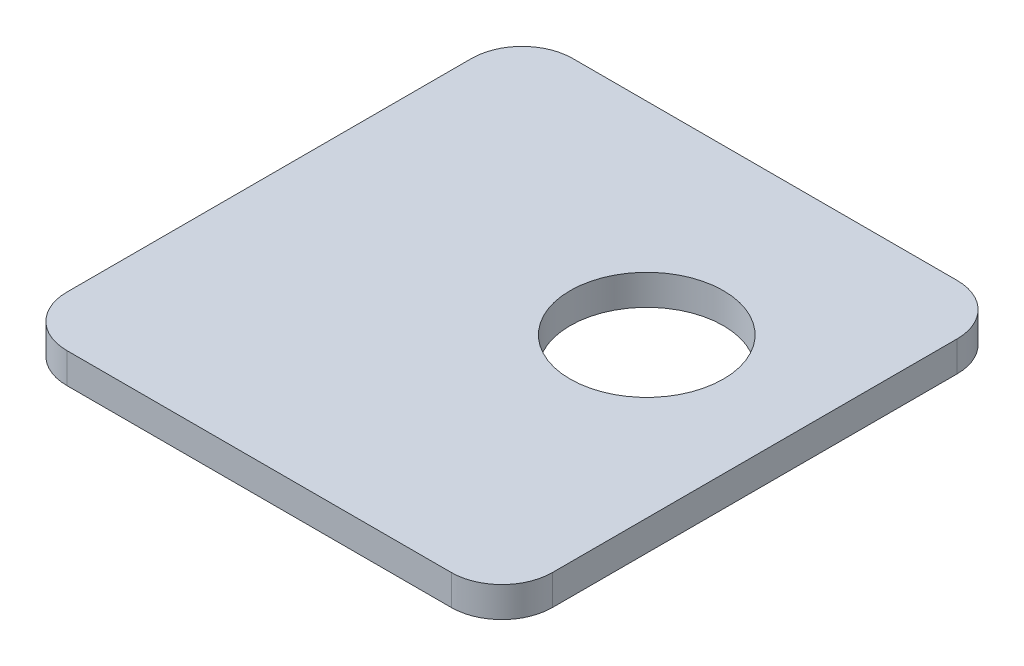
ISO-10303-21;
HEADER;
FILE_DESCRIPTION(('STEP AP214'),'2;1');
FILE_NAME('part.step','',(''),(''),'','','');
FILE_SCHEMA(('AUTOMOTIVE_DESIGN { 1 0 10303 214 1 1 1 1 }'));
ENDSEC;
DATA;
#1=APPLICATION_CONTEXT('core data for automotive mechanical design processes');
#2=APPLICATION_PROTOCOL_DEFINITION('international standard','automotive_design',2000,#1);
#3=PRODUCT_CONTEXT('',#1,'mechanical');
#4=PRODUCT('Part','Part','',(#3));
#5=PRODUCT_RELATED_PRODUCT_CATEGORY('part','',(#4));
#6=PRODUCT_DEFINITION_FORMATION('','',#4);
#7=PRODUCT_DEFINITION_CONTEXT('part definition',#1,'design');
#8=PRODUCT_DEFINITION('design','',#6,#7);
#9=PRODUCT_DEFINITION_SHAPE('','',#8);
#10=(LENGTH_UNIT() NAMED_UNIT(*) SI_UNIT(.MILLI.,.METRE.));
#11=(NAMED_UNIT(*) PLANE_ANGLE_UNIT() SI_UNIT($,.RADIAN.));
#12=(NAMED_UNIT(*) SI_UNIT($,.STERADIAN.) SOLID_ANGLE_UNIT());
#13=UNCERTAINTY_MEASURE_WITH_UNIT(LENGTH_MEASURE(1.E-05),#10,'distance_accuracy_value','');
#14=(GEOMETRIC_REPRESENTATION_CONTEXT(3) GLOBAL_UNCERTAINTY_ASSIGNED_CONTEXT((#13)) GLOBAL_UNIT_ASSIGNED_CONTEXT((#10,
#11,#12)) REPRESENTATION_CONTEXT('',''));
#15=CARTESIAN_POINT('',(0.,0.,0.));
#16=DIRECTION('',(0.,0.,1.));
#17=DIRECTION('',(1.,0.,0.));
#18=AXIS2_PLACEMENT_3D('',#15,#16,#17);
#19=CARTESIAN_POINT('',(-19.4222911704242,3.,-24.2066548338471));
#20=DIRECTION('',(0.,-1.,0.));
#21=DIRECTION('',(0.,0.,-1.));
#22=AXIS2_PLACEMENT_3D('',#19,#20,#21);
#23=PLANE('',#22);
#24=CARTESIAN_POINT('',(-19.4222911704242,3.,-24.2066548338471));
#25=DIRECTION('',(0.,1.,0.));
#26=DIRECTION('',(0.,0.,-1.));
#27=AXIS2_PLACEMENT_3D('',#24,#25,#26);
#28=CIRCLE('',#27,5.);
#29=CARTESIAN_POINT('',(-19.4222911704242,3.,-29.2066548338471));
#30=VERTEX_POINT('',#29);
#31=CARTESIAN_POINT('',(-24.4222911704242,3.,-24.2066548338471));
#32=VERTEX_POINT('',#31);
#33=EDGE_CURVE('E145',#30,#32,#28,.T.);
#34=ORIENTED_EDGE('',*,*,#33,.T.);
#35=DIRECTION('',(0.,0.,1.));
#36=VECTOR('',#35,1.);
#37=CARTESIAN_POINT('',(-24.4222911704242,3.,-24.2066548338471));
#38=LINE('',#37,#36);
#39=CARTESIAN_POINT('',(-24.4222911704242,3.,15.7933451661529));
#40=VERTEX_POINT('',#39);
#41=EDGE_CURVE('E93',#32,#40,#38,.T.);
#42=ORIENTED_EDGE('',*,*,#41,.T.);
#43=CARTESIAN_POINT('',(-19.4222911704242,3.,15.7933451661529));
#44=DIRECTION('',(0.,1.,0.));
#45=DIRECTION('',(0.,0.,1.));
#46=AXIS2_PLACEMENT_3D('',#43,#44,#45);
#47=CIRCLE('',#46,5.);
#48=CARTESIAN_POINT('',(-19.4222911704242,3.,20.7933451661529));
#49=VERTEX_POINT('',#48);
#50=EDGE_CURVE('E160',#40,#49,#47,.T.);
#51=ORIENTED_EDGE('',*,*,#50,.T.);
#52=DIRECTION('',(1.,0.,0.));
#53=VECTOR('',#52,1.);
#54=CARTESIAN_POINT('',(-19.4222911704241,3.,20.7933451661529));
#55=LINE('',#54,#53);
#56=CARTESIAN_POINT('',(18.5777088295758,3.,20.7933451661529));
#57=VERTEX_POINT('',#56);
#58=EDGE_CURVE('E173',#49,#57,#55,.T.);
#59=ORIENTED_EDGE('',*,*,#58,.T.);
#60=CARTESIAN_POINT('',(18.5777088295758,3.,15.7933451661529));
#61=DIRECTION('',(0.,1.,0.));
#62=DIRECTION('',(0.,0.,-1.));
#63=AXIS2_PLACEMENT_3D('',#60,#61,#62);
#64=CIRCLE('',#63,5.);
#65=CARTESIAN_POINT('',(23.5777088295758,3.,15.7933451661529));
#66=VERTEX_POINT('',#65);
#67=EDGE_CURVE('E112',#57,#66,#64,.T.);
#68=ORIENTED_EDGE('',*,*,#67,.T.);
#69=DIRECTION('',(0.,0.,-1.));
#70=VECTOR('',#69,1.);
#71=CARTESIAN_POINT('',(23.5777088295758,3.,-24.2066548338471));
#72=LINE('',#71,#70);
#73=CARTESIAN_POINT('',(23.5777088295758,3.,-24.2066548338471));
#74=VERTEX_POINT('',#73);
#75=EDGE_CURVE('E106',#66,#74,#72,.T.);
#76=ORIENTED_EDGE('',*,*,#75,.T.);
#77=CARTESIAN_POINT('',(18.5777088295758,3.,-24.2066548338471));
#78=DIRECTION('',(0.,1.,0.));
#79=DIRECTION('',(0.,0.,1.));
#80=AXIS2_PLACEMENT_3D('',#77,#78,#79);
#81=CIRCLE('',#80,5.);
#82=CARTESIAN_POINT('',(18.5777088295758,3.,-29.2066548338471));
#83=VERTEX_POINT('',#82);
#84=EDGE_CURVE('E110',#74,#83,#81,.T.);
#85=ORIENTED_EDGE('',*,*,#84,.T.);
#86=DIRECTION('',(-1.,0.,0.));
#87=VECTOR('',#86,1.);
#88=CARTESIAN_POINT('',(-19.4222911704242,3.,-29.2066548338471));
#89=LINE('',#88,#87);
#90=EDGE_CURVE('E50',#83,#30,#89,.T.);
#91=ORIENTED_EDGE('',*,*,#90,.T.);
#92=EDGE_LOOP('',(#34,#42,#51,#59,#68,#76,#85,#91));
#93=FACE_BOUND('',#92,.T.);
#94=CARTESIAN_POINT('',(7.89472563006053,3.,-9.20829129453708));
#95=DIRECTION('',(0.,1.,0.));
#96=DIRECTION('',(0.,0.,1.));
#97=AXIS2_PLACEMENT_3D('',#94,#95,#96);
#98=CIRCLE('',#97,7.575);
#99=CARTESIAN_POINT('',(7.89472563006053,3.,-1.63329129453708));
#100=VERTEX_POINT('',#99);
#101=EDGE_CURVE('E134',#100,#100,#98,.T.);
#102=ORIENTED_EDGE('',*,*,#101,.F.);
#103=EDGE_LOOP('',(#102));
#104=FACE_BOUND('',#103,.T.);
#105=ADVANCED_FACE('F33',(#93,#104),#23,.F.);
#106=CARTESIAN_POINT('',(-19.4222911704242,0.,-24.2066548338471));
#107=DIRECTION('',(0.,-1.,0.));
#108=DIRECTION('',(0.,0.,-1.));
#109=AXIS2_PLACEMENT_3D('',#106,#107,#108);
#110=PLANE('',#109);
#111=CARTESIAN_POINT('',(-19.4222911704242,0.,-24.2066548338471));
#112=DIRECTION('',(0.,1.,0.));
#113=DIRECTION('',(0.,0.,-1.));
#114=AXIS2_PLACEMENT_3D('',#111,#112,#113);
#115=CIRCLE('',#114,5.);
#116=CARTESIAN_POINT('',(-19.4222911704242,0.,-29.2066548338471));
#117=VERTEX_POINT('',#116);
#118=CARTESIAN_POINT('',(-24.4222911704242,0.,-24.2066548338471));
#119=VERTEX_POINT('',#118);
#120=EDGE_CURVE('E130',#117,#119,#115,.T.);
#121=ORIENTED_EDGE('',*,*,#120,.F.);
#122=DIRECTION('',(-1.,0.,0.));
#123=VECTOR('',#122,1.);
#124=CARTESIAN_POINT('',(-19.4222911704242,0.,-29.2066548338471));
#125=LINE('',#124,#123);
#126=CARTESIAN_POINT('',(18.5777088295758,0.,-29.2066548338471));
#127=VERTEX_POINT('',#126);
#128=EDGE_CURVE('E85',#127,#117,#125,.T.);
#129=ORIENTED_EDGE('',*,*,#128,.F.);
#130=CARTESIAN_POINT('',(18.5777088295758,0.,-24.2066548338471));
#131=DIRECTION('',(0.,1.,0.));
#132=DIRECTION('',(0.,0.,1.));
#133=AXIS2_PLACEMENT_3D('',#130,#131,#132);
#134=CIRCLE('',#133,5.);
#135=CARTESIAN_POINT('',(23.5777088295758,0.,-24.2066548338471));
#136=VERTEX_POINT('',#135);
#137=EDGE_CURVE('E79',#136,#127,#134,.T.);
#138=ORIENTED_EDGE('',*,*,#137,.F.);
#139=DIRECTION('',(0.,0.,-1.));
#140=VECTOR('',#139,1.);
#141=CARTESIAN_POINT('',(23.5777088295758,0.,-24.2066548338471));
#142=LINE('',#141,#140);
#143=CARTESIAN_POINT('',(23.5777088295758,0.,15.7933451661529));
#144=VERTEX_POINT('',#143);
#145=EDGE_CURVE('E120',#144,#136,#142,.T.);
#146=ORIENTED_EDGE('',*,*,#145,.F.);
#147=CARTESIAN_POINT('',(18.5777088295758,0.,15.7933451661529));
#148=DIRECTION('',(0.,1.,0.));
#149=DIRECTION('',(0.,0.,-1.));
#150=AXIS2_PLACEMENT_3D('',#147,#148,#149);
#151=CIRCLE('',#150,5.);
#152=CARTESIAN_POINT('',(18.5777088295758,0.,20.7933451661529));
#153=VERTEX_POINT('',#152);
#154=EDGE_CURVE('E140',#153,#144,#151,.T.);
#155=ORIENTED_EDGE('',*,*,#154,.F.);
#156=DIRECTION('',(1.,0.,0.));
#157=VECTOR('',#156,1.);
#158=CARTESIAN_POINT('',(-19.4222911704241,0.,20.7933451661529));
#159=LINE('',#158,#157);
#160=CARTESIAN_POINT('',(-19.4222911704242,0.,20.7933451661529));
#161=VERTEX_POINT('',#160);
#162=EDGE_CURVE('E138',#161,#153,#159,.T.);
#163=ORIENTED_EDGE('',*,*,#162,.F.);
#164=CARTESIAN_POINT('',(-19.4222911704242,0.,15.7933451661529));
#165=DIRECTION('',(0.,1.,0.));
#166=DIRECTION('',(0.,0.,1.));
#167=AXIS2_PLACEMENT_3D('',#164,#165,#166);
#168=CIRCLE('',#167,5.);
#169=CARTESIAN_POINT('',(-24.4222911704242,0.,15.7933451661529));
#170=VERTEX_POINT('',#169);
#171=EDGE_CURVE('E136',#170,#161,#168,.T.);
#172=ORIENTED_EDGE('',*,*,#171,.F.);
#173=DIRECTION('',(0.,0.,1.));
#174=VECTOR('',#173,1.);
#175=CARTESIAN_POINT('',(-24.4222911704242,0.,-24.2066548338471));
#176=LINE('',#175,#174);
#177=EDGE_CURVE('E133',#119,#170,#176,.T.);
#178=ORIENTED_EDGE('',*,*,#177,.F.);
#179=EDGE_LOOP('',(#121,#129,#138,#146,#155,#163,#172,#178));
#180=FACE_BOUND('',#179,.T.);
#181=CARTESIAN_POINT('',(7.89472563006053,0.,-9.20829129453708));
#182=DIRECTION('',(0.,1.,0.));
#183=DIRECTION('',(0.,0.,1.));
#184=AXIS2_PLACEMENT_3D('',#181,#182,#183);
#185=CIRCLE('',#184,7.575);
#186=CARTESIAN_POINT('',(7.89472563006053,0.,-1.63329129453708));
#187=VERTEX_POINT('',#186);
#188=EDGE_CURVE('E179',#187,#187,#185,.T.);
#189=ORIENTED_EDGE('',*,*,#188,.T.);
#190=EDGE_LOOP('',(#189));
#191=FACE_BOUND('',#190,.T.);
#192=ADVANCED_FACE('F164',(#180,#191),#110,.T.);
#193=CARTESIAN_POINT('',(-19.4222911704242,3.,-24.2066548338471));
#194=DIRECTION('',(0.,-1.,0.));
#195=DIRECTION('',(0.,0.,-1.));
#196=AXIS2_PLACEMENT_3D('',#193,#194,#195);
#197=CYLINDRICAL_SURFACE('',#196,5.);
#198=ORIENTED_EDGE('',*,*,#120,.T.);
#199=DIRECTION('',(0.,-1.,0.));
#200=VECTOR('',#199,1.);
#201=CARTESIAN_POINT('',(-24.4222911704242,3.,-24.2066548338471));
#202=LINE('',#201,#200);
#203=EDGE_CURVE('E11',#32,#119,#202,.T.);
#204=ORIENTED_EDGE('',*,*,#203,.F.);
#205=ORIENTED_EDGE('',*,*,#33,.F.);
#206=DIRECTION('',(0.,-1.,0.));
#207=VECTOR('',#206,1.);
#208=CARTESIAN_POINT('',(-19.4222911704242,3.,-29.2066548338471));
#209=LINE('',#208,#207);
#210=EDGE_CURVE('E126',#30,#117,#209,.T.);
#211=ORIENTED_EDGE('',*,*,#210,.T.);
#212=EDGE_LOOP('',(#198,#204,#205,#211));
#213=FACE_BOUND('',#212,.T.);
#214=ADVANCED_FACE('F35',(#213),#197,.T.);
#215=CARTESIAN_POINT('',(-24.4222911704242,3.,-24.2066548338471));
#216=DIRECTION('',(1.,0.,0.));
#217=DIRECTION('',(0.,0.,-1.));
#218=AXIS2_PLACEMENT_3D('',#215,#216,#217);
#219=PLANE('',#218);
#220=ORIENTED_EDGE('',*,*,#177,.T.);
#221=DIRECTION('',(0.,-1.,0.));
#222=VECTOR('',#221,1.);
#223=CARTESIAN_POINT('',(-24.4222911704242,3.,15.7933451661529));
#224=LINE('',#223,#222);
#225=EDGE_CURVE('E42',#40,#170,#224,.T.);
#226=ORIENTED_EDGE('',*,*,#225,.F.);
#227=ORIENTED_EDGE('',*,*,#41,.F.);
#228=ORIENTED_EDGE('',*,*,#203,.T.);
#229=EDGE_LOOP('',(#220,#226,#227,#228));
#230=FACE_BOUND('',#229,.T.);
#231=ADVANCED_FACE('F207',(#230),#219,.F.);
#232=CARTESIAN_POINT('',(-19.4222911704242,3.,15.7933451661529));
#233=DIRECTION('',(0.,-1.,0.));
#234=DIRECTION('',(0.,0.,-1.));
#235=AXIS2_PLACEMENT_3D('',#232,#233,#234);
#236=CYLINDRICAL_SURFACE('',#235,5.);
#237=ORIENTED_EDGE('',*,*,#171,.T.);
#238=DIRECTION('',(0.,-1.,0.));
#239=VECTOR('',#238,1.);
#240=CARTESIAN_POINT('',(-19.4222911704242,3.,20.7933451661529));
#241=LINE('',#240,#239);
#242=EDGE_CURVE('E152',#49,#161,#241,.T.);
#243=ORIENTED_EDGE('',*,*,#242,.F.);
#244=ORIENTED_EDGE('',*,*,#50,.F.);
#245=ORIENTED_EDGE('',*,*,#225,.T.);
#246=EDGE_LOOP('',(#237,#243,#244,#245));
#247=FACE_BOUND('',#246,.T.);
#248=ADVANCED_FACE('F158',(#247),#236,.T.);
#249=CARTESIAN_POINT('',(-19.4222911704241,3.,20.7933451661529));
#250=DIRECTION('',(0.,0.,-1.));
#251=DIRECTION('',(-1.,0.,0.));
#252=AXIS2_PLACEMENT_3D('',#249,#250,#251);
#253=PLANE('',#252);
#254=ORIENTED_EDGE('',*,*,#162,.T.);
#255=DIRECTION('',(0.,-1.,0.));
#256=VECTOR('',#255,1.);
#257=CARTESIAN_POINT('',(18.5777088295758,3.,20.7933451661529));
#258=LINE('',#257,#256);
#259=EDGE_CURVE('E149',#57,#153,#258,.T.);
#260=ORIENTED_EDGE('',*,*,#259,.F.);
#261=ORIENTED_EDGE('',*,*,#58,.F.);
#262=ORIENTED_EDGE('',*,*,#242,.T.);
#263=EDGE_LOOP('',(#254,#260,#261,#262));
#264=FACE_BOUND('',#263,.T.);
#265=ADVANCED_FACE('F169',(#264),#253,.F.);
#266=CARTESIAN_POINT('',(18.5777088295758,3.,15.7933451661529));
#267=DIRECTION('',(0.,-1.,0.));
#268=DIRECTION('',(0.,0.,-1.));
#269=AXIS2_PLACEMENT_3D('',#266,#267,#268);
#270=CYLINDRICAL_SURFACE('',#269,5.);
#271=ORIENTED_EDGE('',*,*,#154,.T.);
#272=DIRECTION('',(0.,-1.,0.));
#273=VECTOR('',#272,1.);
#274=CARTESIAN_POINT('',(23.5777088295758,3.,15.7933451661529));
#275=LINE('',#274,#273);
#276=EDGE_CURVE('E121',#66,#144,#275,.T.);
#277=ORIENTED_EDGE('',*,*,#276,.F.);
#278=ORIENTED_EDGE('',*,*,#67,.F.);
#279=ORIENTED_EDGE('',*,*,#259,.T.);
#280=EDGE_LOOP('',(#271,#277,#278,#279));
#281=FACE_BOUND('',#280,.T.);
#282=ADVANCED_FACE('F172',(#281),#270,.T.);
#283=CARTESIAN_POINT('',(23.5777088295758,3.,-24.2066548338471));
#284=DIRECTION('',(-1.,0.,0.));
#285=DIRECTION('',(0.,0.,1.));
#286=AXIS2_PLACEMENT_3D('',#283,#284,#285);
#287=PLANE('',#286);
#288=ORIENTED_EDGE('',*,*,#145,.T.);
#289=DIRECTION('',(0.,-1.,0.));
#290=VECTOR('',#289,1.);
#291=CARTESIAN_POINT('',(23.5777088295758,3.,-24.2066548338471));
#292=LINE('',#291,#290);
#293=EDGE_CURVE('E117',#74,#136,#292,.T.);
#294=ORIENTED_EDGE('',*,*,#293,.F.);
#295=ORIENTED_EDGE('',*,*,#75,.F.);
#296=ORIENTED_EDGE('',*,*,#276,.T.);
#297=EDGE_LOOP('',(#288,#294,#295,#296));
#298=FACE_BOUND('',#297,.T.);
#299=ADVANCED_FACE('F118',(#298),#287,.F.);
#300=CARTESIAN_POINT('',(18.5777088295758,3.,-24.2066548338471));
#301=DIRECTION('',(0.,-1.,0.));
#302=DIRECTION('',(0.,0.,-1.));
#303=AXIS2_PLACEMENT_3D('',#300,#301,#302);
#304=CYLINDRICAL_SURFACE('',#303,5.);
#305=ORIENTED_EDGE('',*,*,#137,.T.);
#306=DIRECTION('',(0.,-1.,0.));
#307=VECTOR('',#306,1.);
#308=CARTESIAN_POINT('',(18.5777088295758,3.,-29.2066548338471));
#309=LINE('',#308,#307);
#310=EDGE_CURVE('E122',#83,#127,#309,.T.);
#311=ORIENTED_EDGE('',*,*,#310,.F.);
#312=ORIENTED_EDGE('',*,*,#84,.F.);
#313=ORIENTED_EDGE('',*,*,#293,.T.);
#314=EDGE_LOOP('',(#305,#311,#312,#313));
#315=FACE_BOUND('',#314,.T.);
#316=ADVANCED_FACE('F124',(#315),#304,.T.);
#317=CARTESIAN_POINT('',(-19.4222911704242,3.,-29.2066548338471));
#318=DIRECTION('',(0.,0.,1.));
#319=DIRECTION('',(1.,0.,0.));
#320=AXIS2_PLACEMENT_3D('',#317,#318,#319);
#321=PLANE('',#320);
#322=ORIENTED_EDGE('',*,*,#128,.T.);
#323=ORIENTED_EDGE('',*,*,#210,.F.);
#324=ORIENTED_EDGE('',*,*,#90,.F.);
#325=ORIENTED_EDGE('',*,*,#310,.T.);
#326=EDGE_LOOP('',(#322,#323,#324,#325));
#327=FACE_BOUND('',#326,.T.);
#328=ADVANCED_FACE('F195',(#327),#321,.F.);
#329=CARTESIAN_POINT('',(7.89472563006053,3.,-9.20829129453708));
#330=DIRECTION('',(0.,-1.,0.));
#331=DIRECTION('',(0.,0.,-1.));
#332=AXIS2_PLACEMENT_3D('',#329,#330,#331);
#333=CYLINDRICAL_SURFACE('',#332,7.575);
#334=ORIENTED_EDGE('',*,*,#101,.T.);
#335=EDGE_LOOP('',(#334));
#336=FACE_BOUND('',#335,.T.);
#337=ORIENTED_EDGE('',*,*,#188,.F.);
#338=EDGE_LOOP('',(#337));
#339=FACE_BOUND('',#338,.T.);
#340=ADVANCED_FACE('F185',(#336,#339),#333,.F.);
#341=CLOSED_SHELL('',(#105,#192,#214,#231,#248,#265,#282,#299,#316,#328,#340));
#342=MANIFOLD_SOLID_BREP('B2',#341);
#343=ADVANCED_BREP_SHAPE_REPRESENTATION('',(#18,#342),#14);
#344=SHAPE_DEFINITION_REPRESENTATION(#9,#343);
ENDSEC;
END-ISO-10303-21;
